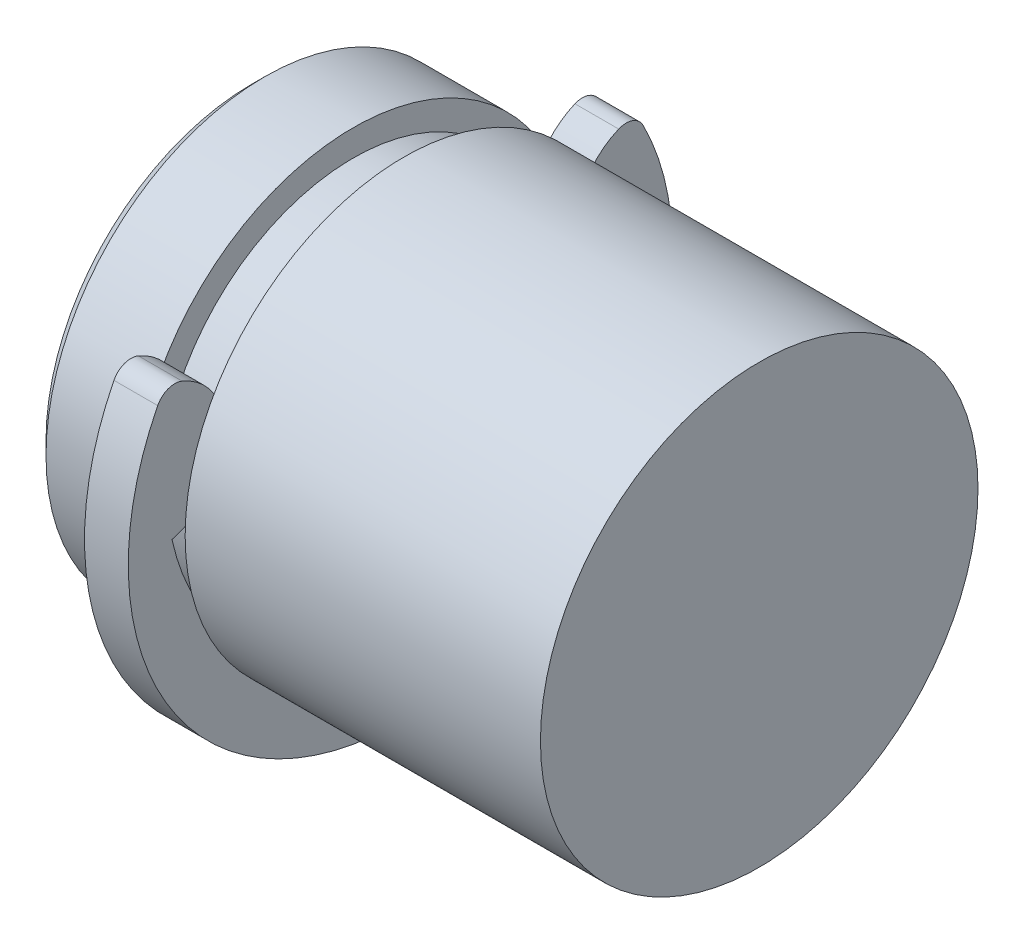
ISO-10303-21;
HEADER;
FILE_DESCRIPTION(('STEP AP214'),'2;1');
FILE_NAME('part.step','',(''),(''),'','','');
FILE_SCHEMA(('AUTOMOTIVE_DESIGN { 1 0 10303 214 1 1 1 1 }'));
ENDSEC;
DATA;
#1=APPLICATION_CONTEXT('core data for automotive mechanical design processes');
#2=APPLICATION_PROTOCOL_DEFINITION('international standard','automotive_design',2000,#1);
#3=PRODUCT_CONTEXT('',#1,'mechanical');
#4=PRODUCT('Part','Part','',(#3));
#5=PRODUCT_RELATED_PRODUCT_CATEGORY('part','',(#4));
#6=PRODUCT_DEFINITION_FORMATION('','',#4);
#7=PRODUCT_DEFINITION_CONTEXT('part definition',#1,'design');
#8=PRODUCT_DEFINITION('design','',#6,#7);
#9=PRODUCT_DEFINITION_SHAPE('','',#8);
#10=(LENGTH_UNIT() NAMED_UNIT(*) SI_UNIT(.MILLI.,.METRE.));
#11=(NAMED_UNIT(*) PLANE_ANGLE_UNIT() SI_UNIT($,.RADIAN.));
#12=(NAMED_UNIT(*) SI_UNIT($,.STERADIAN.) SOLID_ANGLE_UNIT());
#13=UNCERTAINTY_MEASURE_WITH_UNIT(LENGTH_MEASURE(1.E-05),#10,'distance_accuracy_value','');
#14=(GEOMETRIC_REPRESENTATION_CONTEXT(3) GLOBAL_UNCERTAINTY_ASSIGNED_CONTEXT((#13)) GLOBAL_UNIT_ASSIGNED_CONTEXT((#10,
#11,#12)) REPRESENTATION_CONTEXT('',''));
#15=CARTESIAN_POINT('',(0.,0.,0.));
#16=DIRECTION('',(0.,0.,1.));
#17=DIRECTION('',(1.,0.,0.));
#18=AXIS2_PLACEMENT_3D('',#15,#16,#17);
#19=CARTESIAN_POINT('',(-0.3175,0.846512328023,1.77963484466));
#20=DIRECTION('',(-1.,0.,0.));
#21=DIRECTION('',(0.,0.,1.));
#22=AXIS2_PLACEMENT_3D('',#19,#20,#21);
#23=PLANE('',#22);
#24=CARTESIAN_POINT('',(-0.317499999776,0.,0.));
#25=DIRECTION('',(-1.,0.,0.));
#26=DIRECTION('',(0.,0.,1.));
#27=AXIS2_PLACEMENT_3D('',#24,#25,#26);
#28=CIRCLE('',#27,3.9497);
#29=CARTESIAN_POINT('',(-0.317499999776,1.78646666666719,3.52259377999924));
#30=VERTEX_POINT('',#29);
#31=CARTESIAN_POINT('',(-0.317499999776,1.78646666666706,-3.52259377999898));
#32=VERTEX_POINT('',#31);
#33=EDGE_CURVE('P0_E91',#30,#32,#28,.F.);
#34=ORIENTED_EDGE('',*,*,#33,.F.);
#35=CARTESIAN_POINT('',(-0.317499999776,1.66096845654,3.27513368313));
#36=DIRECTION('',(-1.,0.,0.));
#37=DIRECTION('',(0.,0.,1.));
#38=AXIS2_PLACEMENT_3D('',#35,#36,#37);
#39=CIRCLE('',#38,0.277464052244);
#40=CARTESIAN_POINT('',(-0.317499999845737,1.9168795431061,3.16791513966898));
#41=VERTEX_POINT('',#40);
#42=EDGE_CURVE('P0_E71',#30,#41,#39,.T.);
#43=ORIENTED_EDGE('',*,*,#42,.T.);
#44=CARTESIAN_POINT('',(-0.317499999776,0.982787689222,3.55926968931));
#45=DIRECTION('',(-1.,0.,0.));
#46=DIRECTION('',(0.,0.,1.));
#47=AXIS2_PLACEMENT_3D('',#44,#45,#46);
#48=CIRCLE('',#47,1.01276155882);
#49=CARTESIAN_POINT('',(-0.317499999776,-3.28220523676537E-12,3.31469999999682));
#50=VERTEX_POINT('',#49);
#51=EDGE_CURVE('P0_E20',#41,#50,#48,.T.);
#52=ORIENTED_EDGE('',*,*,#51,.T.);
#53=CARTESIAN_POINT('',(-0.317499999776,0.710236966825,0.));
#54=DIRECTION('',(-1.,0.,0.));
#55=DIRECTION('',(0.,0.,1.));
#56=AXIS2_PLACEMENT_3D('',#53,#54,#55);
#57=CIRCLE('',#56,3.38993696682);
#58=CARTESIAN_POINT('',(-0.317499999776,-3.28231365698262E-12,-3.31469999999682));
#59=VERTEX_POINT('',#58);
#60=EDGE_CURVE('P0_E69',#50,#59,#57,.F.);
#61=ORIENTED_EDGE('',*,*,#60,.T.);
#62=CARTESIAN_POINT('',(-0.317499999776,0.982787689222,-3.55926968931));
#63=DIRECTION('',(-1.,0.,0.));
#64=DIRECTION('',(0.,0.,1.));
#65=AXIS2_PLACEMENT_3D('',#62,#63,#64);
#66=CIRCLE('',#65,1.01276155882);
#67=CARTESIAN_POINT('',(-0.317499999776,1.9168795431033,-3.16791513967015));
#68=VERTEX_POINT('',#67);
#69=EDGE_CURVE('P0_E98',#68,#59,#66,.F.);
#70=ORIENTED_EDGE('',*,*,#69,.F.);
#71=CARTESIAN_POINT('',(-0.317499999776,1.66096845654,-3.27513368313));
#72=DIRECTION('',(-1.,0.,0.));
#73=DIRECTION('',(0.,0.,1.));
#74=AXIS2_PLACEMENT_3D('',#71,#72,#73);
#75=CIRCLE('',#74,0.277464052244);
#76=EDGE_CURVE('P0_E97',#32,#68,#75,.F.);
#77=ORIENTED_EDGE('',*,*,#76,.F.);
#78=EDGE_LOOP('',(#34,#43,#52,#61,#70,#77));
#79=FACE_BOUND('',#78,.T.);
#80=ADVANCED_FACE('P0_F17',(#79),#23,.T.);
#81=CARTESIAN_POINT('',(0.3175,0.710236966825,0.));
#82=DIRECTION('',(-1.,0.,0.));
#83=DIRECTION('',(0.,0.,1.));
#84=AXIS2_PLACEMENT_3D('',#81,#82,#83);
#85=CYLINDRICAL_SURFACE('',#84,3.38993696682);
#86=DIRECTION('',(-1.,0.,0.));
#87=VECTOR('',#86,1.);
#88=CARTESIAN_POINT('',(0.3175,-3.83655780755721E-12,3.31469999999904));
#89=LINE('',#88,#87);
#90=CARTESIAN_POINT('',(0.3175,-3.28247628730849E-12,3.31469999999682));
#91=VERTEX_POINT('',#90);
#92=EDGE_CURVE('P0_E77',#91,#50,#89,.T.);
#93=ORIENTED_EDGE('',*,*,#92,.F.);
#94=CARTESIAN_POINT('',(0.3175,0.710236966825,0.));
#95=DIRECTION('',(-1.,0.,0.));
#96=DIRECTION('',(0.,0.,1.));
#97=AXIS2_PLACEMENT_3D('',#94,#95,#96);
#98=CIRCLE('',#97,3.38993696682);
#99=CARTESIAN_POINT('',(0.3175,-3.28231365698262E-12,-3.31469999999682));
#100=VERTEX_POINT('',#99);
#101=EDGE_CURVE('P0_E82',#91,#100,#98,.F.);
#102=ORIENTED_EDGE('',*,*,#101,.T.);
#103=DIRECTION('',(-1.,0.,0.));
#104=VECTOR('',#103,1.);
#105=CARTESIAN_POINT('',(0.3175,-3.8367746479917E-12,-3.31469999999905));
#106=LINE('',#105,#104);
#107=EDGE_CURVE('P0_E78',#59,#100,#106,.F.);
#108=ORIENTED_EDGE('',*,*,#107,.F.);
#109=ORIENTED_EDGE('',*,*,#60,.F.);
#110=EDGE_LOOP('',(#93,#102,#108,#109));
#111=FACE_BOUND('',#110,.T.);
#112=ADVANCED_FACE('P0_F75',(#111),#85,.F.);
#113=CARTESIAN_POINT('',(0.3175,0.982787689222,-3.55926968931));
#114=DIRECTION('',(-1.,0.,0.));
#115=DIRECTION('',(0.,0.,1.));
#116=AXIS2_PLACEMENT_3D('',#113,#114,#115);
#117=CYLINDRICAL_SURFACE('',#116,1.01276155882);
#118=DIRECTION('',(-1.,0.,0.));
#119=VECTOR('',#118,1.);
#120=CARTESIAN_POINT('',(0.3175,1.91687954310275,-3.16791513966885));
#121=LINE('',#120,#119);
#122=CARTESIAN_POINT('',(0.3175,1.9168795431033,-3.16791513967015));
#123=VERTEX_POINT('',#122);
#124=EDGE_CURVE('P0_E94',#68,#123,#121,.F.);
#125=ORIENTED_EDGE('',*,*,#124,.F.);
#126=ORIENTED_EDGE('',*,*,#69,.T.);
#127=ORIENTED_EDGE('',*,*,#107,.T.);
#128=CARTESIAN_POINT('',(0.3175,0.982787689222,-3.55926968931));
#129=DIRECTION('',(-1.,0.,0.));
#130=DIRECTION('',(0.,0.,1.));
#131=AXIS2_PLACEMENT_3D('',#128,#129,#130);
#132=CIRCLE('',#131,1.01276155882);
#133=EDGE_CURVE('P0_E84',#100,#123,#132,.T.);
#134=ORIENTED_EDGE('',*,*,#133,.T.);
#135=EDGE_LOOP('',(#125,#126,#127,#134));
#136=FACE_BOUND('',#135,.T.);
#137=ADVANCED_FACE('P0_F112',(#136),#117,.T.);
#138=CARTESIAN_POINT('',(0.3175,1.66096845654,-3.27513368313));
#139=DIRECTION('',(-1.,0.,0.));
#140=DIRECTION('',(0.,0.,1.));
#141=AXIS2_PLACEMENT_3D('',#138,#139,#140);
#142=CYLINDRICAL_SURFACE('',#141,0.277464052244);
#143=CARTESIAN_POINT('',(0.3175,1.66096845654,-3.27513368313));
#144=DIRECTION('',(-1.,0.,0.));
#145=DIRECTION('',(0.,0.,1.));
#146=AXIS2_PLACEMENT_3D('',#143,#144,#145);
#147=CIRCLE('',#146,0.277464052244);
#148=CARTESIAN_POINT('',(0.3175,1.78646666666706,-3.52259377999898));
#149=VERTEX_POINT('',#148);
#150=EDGE_CURVE('P0_E104',#123,#149,#147,.T.);
#151=ORIENTED_EDGE('',*,*,#150,.T.);
#152=DIRECTION('',(-1.,0.,0.));
#153=VECTOR('',#152,1.);
#154=CARTESIAN_POINT('',(0.3175,1.78646666666899,-3.522593779998));
#155=LINE('',#154,#153);
#156=EDGE_CURVE('P0_E92',#32,#149,#155,.F.);
#157=ORIENTED_EDGE('',*,*,#156,.F.);
#158=ORIENTED_EDGE('',*,*,#76,.T.);
#159=ORIENTED_EDGE('',*,*,#124,.T.);
#160=EDGE_LOOP('',(#151,#157,#158,#159));
#161=FACE_BOUND('',#160,.T.);
#162=ADVANCED_FACE('P0_F118',(#161),#142,.T.);
#163=CARTESIAN_POINT('',(0.3175,0.,0.));
#164=DIRECTION('',(-1.,0.,0.));
#165=DIRECTION('',(0.,0.,1.));
#166=AXIS2_PLACEMENT_3D('',#163,#164,#165);
#167=CYLINDRICAL_SURFACE('',#166,3.9497);
#168=DIRECTION('',(-1.,0.,0.));
#169=VECTOR('',#168,1.);
#170=CARTESIAN_POINT('',(0.3175,1.78646666666912,3.52259377999826));
#171=LINE('',#170,#169);
#172=CARTESIAN_POINT('',(0.3175,1.78646666666719,3.52259377999924));
#173=VERTEX_POINT('',#172);
#174=EDGE_CURVE('P0_E86',#30,#173,#171,.F.);
#175=ORIENTED_EDGE('',*,*,#174,.F.);
#176=ORIENTED_EDGE('',*,*,#33,.T.);
#177=ORIENTED_EDGE('',*,*,#156,.T.);
#178=CARTESIAN_POINT('',(0.3175,0.,0.));
#179=DIRECTION('',(-1.,0.,0.));
#180=DIRECTION('',(0.,0.,1.));
#181=AXIS2_PLACEMENT_3D('',#178,#179,#180);
#182=CIRCLE('',#181,3.9497);
#183=EDGE_CURVE('P0_E102',#149,#173,#182,.T.);
#184=ORIENTED_EDGE('',*,*,#183,.T.);
#185=EDGE_LOOP('',(#175,#176,#177,#184));
#186=FACE_BOUND('',#185,.T.);
#187=ADVANCED_FACE('P0_F122',(#186),#167,.T.);
#188=CARTESIAN_POINT('',(0.3175,1.66096845654,3.27513368313));
#189=DIRECTION('',(-1.,0.,0.));
#190=DIRECTION('',(0.,0.,1.));
#191=AXIS2_PLACEMENT_3D('',#188,#189,#190);
#192=CYLINDRICAL_SURFACE('',#191,0.277464052244);
#193=CARTESIAN_POINT('',(0.3175,1.66096845654,3.27513368313));
#194=DIRECTION('',(-1.,0.,0.));
#195=DIRECTION('',(0.,0.,1.));
#196=AXIS2_PLACEMENT_3D('',#193,#194,#195);
#197=CIRCLE('',#196,0.277464052244);
#198=CARTESIAN_POINT('',(0.3175,1.9168795431089,3.1679151396678));
#199=VERTEX_POINT('',#198);
#200=EDGE_CURVE('P0_E26',#173,#199,#197,.T.);
#201=ORIENTED_EDGE('',*,*,#200,.T.);
#202=DIRECTION('',(-1.,0.,0.));
#203=VECTOR('',#202,1.);
#204=CARTESIAN_POINT('',(0.3175,1.91687954310836,3.1679151396665));
#205=LINE('',#204,#203);
#206=EDGE_CURVE('P0_E34',#41,#199,#205,.F.);
#207=ORIENTED_EDGE('',*,*,#206,.F.);
#208=ORIENTED_EDGE('',*,*,#42,.F.);
#209=ORIENTED_EDGE('',*,*,#174,.T.);
#210=EDGE_LOOP('',(#201,#207,#208,#209));
#211=FACE_BOUND('',#210,.T.);
#212=ADVANCED_FACE('P0_F127',(#211),#192,.T.);
#213=CARTESIAN_POINT('',(0.3175,0.982787689222,3.55926968931));
#214=DIRECTION('',(-1.,0.,0.));
#215=DIRECTION('',(0.,0.,1.));
#216=AXIS2_PLACEMENT_3D('',#213,#214,#215);
#217=CYLINDRICAL_SURFACE('',#216,1.01276155882);
#218=ORIENTED_EDGE('',*,*,#92,.T.);
#219=ORIENTED_EDGE('',*,*,#51,.F.);
#220=ORIENTED_EDGE('',*,*,#206,.T.);
#221=CARTESIAN_POINT('',(0.3175,0.982787689222,3.55926968931));
#222=DIRECTION('',(-1.,0.,0.));
#223=DIRECTION('',(0.,0.,1.));
#224=AXIS2_PLACEMENT_3D('',#221,#222,#223);
#225=CIRCLE('',#224,1.01276155882);
#226=EDGE_CURVE('P0_E11',#199,#91,#225,.T.);
#227=ORIENTED_EDGE('',*,*,#226,.T.);
#228=EDGE_LOOP('',(#218,#219,#220,#227));
#229=FACE_BOUND('',#228,.T.);
#230=ADVANCED_FACE('P0_F80',(#229),#217,.T.);
#231=CARTESIAN_POINT('',(0.3175,0.846512328023,1.77963484466));
#232=DIRECTION('',(-1.,0.,0.));
#233=DIRECTION('',(0.,0.,1.));
#234=AXIS2_PLACEMENT_3D('',#231,#232,#233);
#235=PLANE('',#234);
#236=ORIENTED_EDGE('',*,*,#226,.F.);
#237=ORIENTED_EDGE('',*,*,#200,.F.);
#238=ORIENTED_EDGE('',*,*,#183,.F.);
#239=ORIENTED_EDGE('',*,*,#150,.F.);
#240=ORIENTED_EDGE('',*,*,#133,.F.);
#241=ORIENTED_EDGE('',*,*,#101,.F.);
#242=EDGE_LOOP('',(#236,#237,#238,#239,#240,#241));
#243=FACE_BOUND('',#242,.T.);
#244=ADVANCED_FACE('P0_F125',(#243),#235,.F.);
#245=CLOSED_SHELL('',(#80,#112,#137,#162,#187,#212,#230,#244));
#246=MANIFOLD_SOLID_BREP('P0_B1',#245);
#247=CARTESIAN_POINT('',(-1.8415,-2.9845,0.));
#248=DIRECTION('',(-1.,0.,0.));
#249=DIRECTION('',(0.,-1.,0.));
#250=AXIS2_PLACEMENT_3D('',#247,#248,#249);
#251=PLANE('',#250);
#252=CARTESIAN_POINT('',(-1.84150000001182,0.,0.));
#253=DIRECTION('',(1.,0.,0.));
#254=DIRECTION('',(0.,1.,0.));
#255=AXIS2_PLACEMENT_3D('',#252,#253,#254);
#256=CIRCLE('',#255,2.98449999996819);
#257=CARTESIAN_POINT('',(-1.84150000001182,2.98449999996819,0.));
#258=VERTEX_POINT('',#257);
#259=EDGE_CURVE('P1_E18',#258,#258,#256,.T.);
#260=ORIENTED_EDGE('',*,*,#259,.F.);
#261=EDGE_LOOP('',(#260));
#262=FACE_BOUND('',#261,.T.);
#263=ADVANCED_FACE('P1_F15',(#262),#251,.T.);
#264=CARTESIAN_POINT('',(-1.65100000009488,0.,0.));
#265=DIRECTION('',(1.,0.,0.));
#266=DIRECTION('',(0.,1.,0.));
#267=AXIS2_PLACEMENT_3D('',#264,#265,#266);
#268=CONICAL_SURFACE('',#267,3.17499999988513,0.785398163397448);
#269=ORIENTED_EDGE('',*,*,#259,.T.);
#270=EDGE_LOOP('',(#269));
#271=FACE_BOUND('',#270,.T.);
#272=CARTESIAN_POINT('',(-1.651,0.,0.));
#273=DIRECTION('',(-1.,0.,0.));
#274=DIRECTION('',(0.,0.,1.));
#275=AXIS2_PLACEMENT_3D('',#272,#273,#274);
#276=CIRCLE('',#275,3.175);
#277=CARTESIAN_POINT('',(-1.651,0.,3.175));
#278=VERTEX_POINT('',#277);
#279=EDGE_CURVE('P1_E30',#278,#278,#276,.F.);
#280=ORIENTED_EDGE('',*,*,#279,.F.);
#281=EDGE_LOOP('',(#280));
#282=FACE_BOUND('',#281,.T.);
#283=ADVANCED_FACE('P1_F46',(#271,#282),#268,.T.);
#284=CARTESIAN_POINT('',(5.5245,0.,0.));
#285=DIRECTION('',(-1.,0.,0.));
#286=DIRECTION('',(0.,0.,1.));
#287=AXIS2_PLACEMENT_3D('',#284,#285,#286);
#288=CYLINDRICAL_SURFACE('',#287,3.175);
#289=CARTESIAN_POINT('',(-0.368299999565,0.,0.));
#290=DIRECTION('',(-1.,0.,0.));
#291=DIRECTION('',(0.,0.,1.));
#292=AXIS2_PLACEMENT_3D('',#289,#290,#291);
#293=CIRCLE('',#292,3.175);
#294=CARTESIAN_POINT('',(-0.368299999565,0.,3.175));
#295=VERTEX_POINT('',#294);
#296=EDGE_CURVE('P1_E36',#295,#295,#293,.F.);
#297=ORIENTED_EDGE('',*,*,#296,.F.);
#298=EDGE_LOOP('',(#297));
#299=FACE_BOUND('',#298,.T.);
#300=ORIENTED_EDGE('',*,*,#279,.T.);
#301=EDGE_LOOP('',(#300));
#302=FACE_BOUND('',#301,.T.);
#303=ADVANCED_FACE('P1_F54',(#299,#302),#288,.T.);
#304=CARTESIAN_POINT('',(-0.3683,-2.794,0.));
#305=DIRECTION('',(1.,0.,0.));
#306=DIRECTION('',(0.,1.,0.));
#307=AXIS2_PLACEMENT_3D('',#304,#305,#306);
#308=PLANE('',#307);
#309=CARTESIAN_POINT('',(-0.368299999565,0.,0.));
#310=DIRECTION('',(-1.,0.,0.));
#311=DIRECTION('',(0.,0.,1.));
#312=AXIS2_PLACEMENT_3D('',#309,#310,#311);
#313=CIRCLE('',#312,2.794);
#314=CARTESIAN_POINT('',(-0.368299999565,0.,2.794));
#315=VERTEX_POINT('',#314);
#316=EDGE_CURVE('P1_E34',#315,#315,#313,.F.);
#317=ORIENTED_EDGE('',*,*,#316,.F.);
#318=EDGE_LOOP('',(#317));
#319=FACE_BOUND('',#318,.T.);
#320=ORIENTED_EDGE('',*,*,#296,.T.);
#321=EDGE_LOOP('',(#320));
#322=FACE_BOUND('',#321,.T.);
#323=ADVANCED_FACE('P1_F73',(#319,#322),#308,.T.);
#324=CARTESIAN_POINT('',(5.5245,0.,0.));
#325=DIRECTION('',(-1.,0.,0.));
#326=DIRECTION('',(0.,0.,1.));
#327=AXIS2_PLACEMENT_3D('',#324,#325,#326);
#328=CYLINDRICAL_SURFACE('',#327,2.794);
#329=CARTESIAN_POINT('',(0.368300000846,0.,0.));
#330=DIRECTION('',(-1.,0.,0.));
#331=DIRECTION('',(0.,0.,1.));
#332=AXIS2_PLACEMENT_3D('',#329,#330,#331);
#333=CIRCLE('',#332,2.794);
#334=CARTESIAN_POINT('',(0.368300000846,0.,2.794));
#335=VERTEX_POINT('',#334);
#336=EDGE_CURVE('P1_E27',#335,#335,#333,.F.);
#337=ORIENTED_EDGE('',*,*,#336,.F.);
#338=EDGE_LOOP('',(#337));
#339=FACE_BOUND('',#338,.T.);
#340=ORIENTED_EDGE('',*,*,#316,.T.);
#341=EDGE_LOOP('',(#340));
#342=FACE_BOUND('',#341,.T.);
#343=ADVANCED_FACE('P1_F69',(#339,#342),#328,.T.);
#344=CARTESIAN_POINT('',(5.5245,0.,0.));
#345=DIRECTION('',(1.,0.,0.));
#346=DIRECTION('',(0.,1.,0.));
#347=AXIS2_PLACEMENT_3D('',#344,#345,#346);
#348=PLANE('',#347);
#349=CARTESIAN_POINT('',(5.5245,0.,0.));
#350=DIRECTION('',(-1.,0.,0.));
#351=DIRECTION('',(0.,0.,1.));
#352=AXIS2_PLACEMENT_3D('',#349,#350,#351);
#353=CIRCLE('',#352,3.175);
#354=CARTESIAN_POINT('',(5.5245,0.,3.175));
#355=VERTEX_POINT('',#354);
#356=EDGE_CURVE('P1_E22',#355,#355,#353,.T.);
#357=ORIENTED_EDGE('',*,*,#356,.F.);
#358=EDGE_LOOP('',(#357));
#359=FACE_BOUND('',#358,.T.);
#360=ADVANCED_FACE('P1_F62',(#359),#348,.T.);
#361=CARTESIAN_POINT('',(0.3683,-3.175,0.));
#362=DIRECTION('',(-1.,0.,0.));
#363=DIRECTION('',(0.,-1.,0.));
#364=AXIS2_PLACEMENT_3D('',#361,#362,#363);
#365=PLANE('',#364);
#366=ORIENTED_EDGE('',*,*,#336,.T.);
#367=EDGE_LOOP('',(#366));
#368=FACE_BOUND('',#367,.T.);
#369=CARTESIAN_POINT('',(0.368300000846,0.,0.));
#370=DIRECTION('',(-1.,0.,0.));
#371=DIRECTION('',(0.,0.,1.));
#372=AXIS2_PLACEMENT_3D('',#369,#370,#371);
#373=CIRCLE('',#372,3.175);
#374=CARTESIAN_POINT('',(0.368300000846,0.,3.175));
#375=VERTEX_POINT('',#374);
#376=EDGE_CURVE('P1_E10',#375,#375,#373,.F.);
#377=ORIENTED_EDGE('',*,*,#376,.F.);
#378=EDGE_LOOP('',(#377));
#379=FACE_BOUND('',#378,.T.);
#380=ADVANCED_FACE('P1_F57',(#368,#379),#365,.T.);
#381=CARTESIAN_POINT('',(5.5245,0.,0.));
#382=DIRECTION('',(-1.,0.,0.));
#383=DIRECTION('',(0.,0.,1.));
#384=AXIS2_PLACEMENT_3D('',#381,#382,#383);
#385=CYLINDRICAL_SURFACE('',#384,3.175);
#386=ORIENTED_EDGE('',*,*,#376,.T.);
#387=EDGE_LOOP('',(#386));
#388=FACE_BOUND('',#387,.T.);
#389=ORIENTED_EDGE('',*,*,#356,.T.);
#390=EDGE_LOOP('',(#389));
#391=FACE_BOUND('',#390,.T.);
#392=ADVANCED_FACE('P1_F55',(#388,#391),#385,.T.);
#393=CLOSED_SHELL('',(#263,#283,#303,#323,#343,#360,#380,#392));
#394=MANIFOLD_SOLID_BREP('P1_B1',#393);
#395=ADVANCED_BREP_SHAPE_REPRESENTATION('',(#18,#246,#394),#14);
#396=SHAPE_DEFINITION_REPRESENTATION(#9,#395);
ENDSEC;
END-ISO-10303-21;
